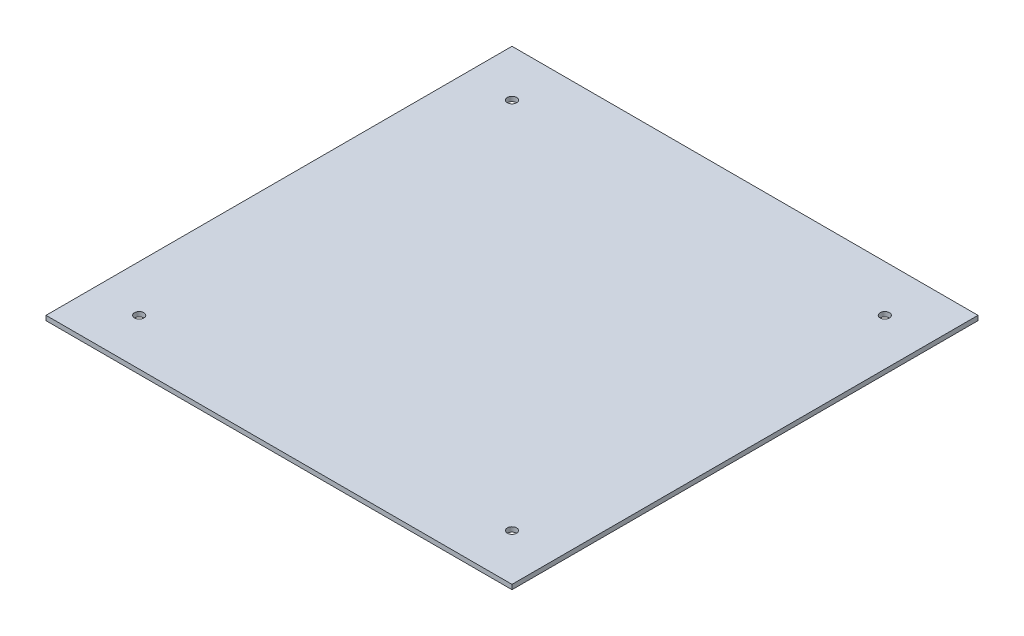
ISO-10303-21;
HEADER;
FILE_DESCRIPTION(('STEP AP214'),'2;1');
FILE_NAME('part.step','',(''),(''),'','','');
FILE_SCHEMA(('AUTOMOTIVE_DESIGN { 1 0 10303 214 1 1 1 1 }'));
ENDSEC;
DATA;
#1=APPLICATION_CONTEXT('core data for automotive mechanical design processes');
#2=APPLICATION_PROTOCOL_DEFINITION('international standard','automotive_design',2000,#1);
#3=PRODUCT_CONTEXT('',#1,'mechanical');
#4=PRODUCT('Part','Part','',(#3));
#5=PRODUCT_RELATED_PRODUCT_CATEGORY('part','',(#4));
#6=PRODUCT_DEFINITION_FORMATION('','',#4);
#7=PRODUCT_DEFINITION_CONTEXT('part definition',#1,'design');
#8=PRODUCT_DEFINITION('design','',#6,#7);
#9=PRODUCT_DEFINITION_SHAPE('','',#8);
#10=(LENGTH_UNIT() NAMED_UNIT(*) SI_UNIT(.MILLI.,.METRE.));
#11=(NAMED_UNIT(*) PLANE_ANGLE_UNIT() SI_UNIT($,.RADIAN.));
#12=(NAMED_UNIT(*) SI_UNIT($,.STERADIAN.) SOLID_ANGLE_UNIT());
#13=UNCERTAINTY_MEASURE_WITH_UNIT(LENGTH_MEASURE(1.E-05),#10,'distance_accuracy_value','');
#14=(GEOMETRIC_REPRESENTATION_CONTEXT(3) GLOBAL_UNCERTAINTY_ASSIGNED_CONTEXT((#13)) GLOBAL_UNIT_ASSIGNED_CONTEXT((#10,
#11,#12)) REPRESENTATION_CONTEXT('',''));
#15=CARTESIAN_POINT('',(0.,0.,0.));
#16=DIRECTION('',(0.,0.,1.));
#17=DIRECTION('',(1.,0.,0.));
#18=AXIS2_PLACEMENT_3D('',#15,#16,#17);
#19=CARTESIAN_POINT('',(250.,5.,-250.));
#20=DIRECTION('',(-1.,0.,0.));
#21=DIRECTION('',(0.,0.,1.));
#22=AXIS2_PLACEMENT_3D('',#19,#20,#21);
#23=PLANE('',#22);
#24=DIRECTION('',(0.,0.,-1.));
#25=VECTOR('',#24,1.);
#26=CARTESIAN_POINT('',(250.,0.,-250.));
#27=LINE('',#26,#25);
#28=CARTESIAN_POINT('',(250.,0.,250.));
#29=VERTEX_POINT('',#28);
#30=CARTESIAN_POINT('',(250.,0.,-250.));
#31=VERTEX_POINT('',#30);
#32=EDGE_CURVE('E101',#29,#31,#27,.T.);
#33=ORIENTED_EDGE('',*,*,#32,.T.);
#34=DIRECTION('',(0.,-1.,0.));
#35=VECTOR('',#34,1.);
#36=CARTESIAN_POINT('',(250.,5.,-250.));
#37=LINE('',#36,#35);
#38=CARTESIAN_POINT('',(250.,5.,-250.));
#39=VERTEX_POINT('',#38);
#40=EDGE_CURVE('E11',#39,#31,#37,.T.);
#41=ORIENTED_EDGE('',*,*,#40,.F.);
#42=DIRECTION('',(0.,0.,-1.));
#43=VECTOR('',#42,1.);
#44=CARTESIAN_POINT('',(250.,5.,-250.));
#45=LINE('',#44,#43);
#46=CARTESIAN_POINT('',(250.,5.,250.));
#47=VERTEX_POINT('',#46);
#48=EDGE_CURVE('E88',#47,#39,#45,.T.);
#49=ORIENTED_EDGE('',*,*,#48,.F.);
#50=DIRECTION('',(0.,-1.,0.));
#51=VECTOR('',#50,1.);
#52=CARTESIAN_POINT('',(250.,5.,250.));
#53=LINE('',#52,#51);
#54=EDGE_CURVE('E97',#47,#29,#53,.T.);
#55=ORIENTED_EDGE('',*,*,#54,.T.);
#56=EDGE_LOOP('',(#33,#41,#49,#55));
#57=FACE_BOUND('',#56,.T.);
#58=ADVANCED_FACE('F35',(#57),#23,.F.);
#59=CARTESIAN_POINT('',(-250.,5.,-250.));
#60=DIRECTION('',(0.,0.,1.));
#61=DIRECTION('',(1.,0.,0.));
#62=AXIS2_PLACEMENT_3D('',#59,#60,#61);
#63=PLANE('',#62);
#64=DIRECTION('',(-1.,0.,0.));
#65=VECTOR('',#64,1.);
#66=CARTESIAN_POINT('',(-250.,0.,-250.));
#67=LINE('',#66,#65);
#68=CARTESIAN_POINT('',(-250.,0.,-250.));
#69=VERTEX_POINT('',#68);
#70=EDGE_CURVE('E92',#31,#69,#67,.T.);
#71=ORIENTED_EDGE('',*,*,#70,.T.);
#72=DIRECTION('',(0.,-1.,0.));
#73=VECTOR('',#72,1.);
#74=CARTESIAN_POINT('',(-250.,5.,-250.));
#75=LINE('',#74,#73);
#76=CARTESIAN_POINT('',(-250.,5.,-250.));
#77=VERTEX_POINT('',#76);
#78=EDGE_CURVE('E44',#77,#69,#75,.T.);
#79=ORIENTED_EDGE('',*,*,#78,.F.);
#80=DIRECTION('',(-1.,0.,0.));
#81=VECTOR('',#80,1.);
#82=CARTESIAN_POINT('',(-250.,5.,-250.));
#83=LINE('',#82,#81);
#84=EDGE_CURVE('E83',#39,#77,#83,.T.);
#85=ORIENTED_EDGE('',*,*,#84,.F.);
#86=ORIENTED_EDGE('',*,*,#40,.T.);
#87=EDGE_LOOP('',(#71,#79,#85,#86));
#88=FACE_BOUND('',#87,.T.);
#89=ADVANCED_FACE('F91',(#88),#63,.F.);
#90=CARTESIAN_POINT('',(-250.,5.,-250.));
#91=DIRECTION('',(1.,0.,0.));
#92=DIRECTION('',(0.,0.,-1.));
#93=AXIS2_PLACEMENT_3D('',#90,#91,#92);
#94=PLANE('',#93);
#95=DIRECTION('',(0.,0.,1.));
#96=VECTOR('',#95,1.);
#97=CARTESIAN_POINT('',(-250.,0.,-250.));
#98=LINE('',#97,#96);
#99=CARTESIAN_POINT('',(-250.,0.,250.));
#100=VERTEX_POINT('',#99);
#101=EDGE_CURVE('E70',#69,#100,#98,.T.);
#102=ORIENTED_EDGE('',*,*,#101,.T.);
#103=DIRECTION('',(0.,-1.,0.));
#104=VECTOR('',#103,1.);
#105=CARTESIAN_POINT('',(-250.,5.,250.));
#106=LINE('',#105,#104);
#107=CARTESIAN_POINT('',(-250.,5.,250.));
#108=VERTEX_POINT('',#107);
#109=EDGE_CURVE('E93',#108,#100,#106,.T.);
#110=ORIENTED_EDGE('',*,*,#109,.F.);
#111=DIRECTION('',(0.,0.,1.));
#112=VECTOR('',#111,1.);
#113=CARTESIAN_POINT('',(-250.,5.,-250.));
#114=LINE('',#113,#112);
#115=EDGE_CURVE('E86',#77,#108,#114,.T.);
#116=ORIENTED_EDGE('',*,*,#115,.F.);
#117=ORIENTED_EDGE('',*,*,#78,.T.);
#118=EDGE_LOOP('',(#102,#110,#116,#117));
#119=FACE_BOUND('',#118,.T.);
#120=ADVANCED_FACE('F95',(#119),#94,.F.);
#121=CARTESIAN_POINT('',(-250.,5.,250.));
#122=DIRECTION('',(0.,0.,-1.));
#123=DIRECTION('',(-1.,0.,0.));
#124=AXIS2_PLACEMENT_3D('',#121,#122,#123);
#125=PLANE('',#124);
#126=DIRECTION('',(1.,0.,0.));
#127=VECTOR('',#126,1.);
#128=CARTESIAN_POINT('',(-250.,0.,250.));
#129=LINE('',#128,#127);
#130=EDGE_CURVE('E76',#100,#29,#129,.T.);
#131=ORIENTED_EDGE('',*,*,#130,.T.);
#132=ORIENTED_EDGE('',*,*,#54,.F.);
#133=DIRECTION('',(1.,0.,0.));
#134=VECTOR('',#133,1.);
#135=CARTESIAN_POINT('',(-250.,5.,250.));
#136=LINE('',#135,#134);
#137=EDGE_CURVE('E53',#108,#47,#136,.T.);
#138=ORIENTED_EDGE('',*,*,#137,.F.);
#139=ORIENTED_EDGE('',*,*,#109,.T.);
#140=EDGE_LOOP('',(#131,#132,#138,#139));
#141=FACE_BOUND('',#140,.T.);
#142=ADVANCED_FACE('F139',(#141),#125,.F.);
#143=CARTESIAN_POINT('',(0.,5.,0.));
#144=DIRECTION('',(0.,1.,0.));
#145=DIRECTION('',(0.,0.,1.));
#146=AXIS2_PLACEMENT_3D('',#143,#144,#145);
#147=PLANE('',#146);
#148=CARTESIAN_POINT('',(200.,5.,200.));
#149=DIRECTION('',(0.,1.,0.));
#150=DIRECTION('',(0.,0.,1.));
#151=AXIS2_PLACEMENT_3D('',#148,#149,#150);
#152=CIRCLE('',#151,4.99999999999999);
#153=CARTESIAN_POINT('',(200.,5.,205.));
#154=VERTEX_POINT('',#153);
#155=EDGE_CURVE('E128',#154,#154,#152,.T.);
#156=ORIENTED_EDGE('',*,*,#155,.F.);
#157=EDGE_LOOP('',(#156));
#158=FACE_BOUND('',#157,.T.);
#159=CARTESIAN_POINT('',(200.,5.,-200.));
#160=DIRECTION('',(0.,1.,0.));
#161=DIRECTION('',(0.,0.,1.));
#162=AXIS2_PLACEMENT_3D('',#159,#160,#161);
#163=CIRCLE('',#162,4.99999999999999);
#164=CARTESIAN_POINT('',(200.,5.,-195.));
#165=VERTEX_POINT('',#164);
#166=EDGE_CURVE('E118',#165,#165,#163,.T.);
#167=ORIENTED_EDGE('',*,*,#166,.F.);
#168=EDGE_LOOP('',(#167));
#169=FACE_BOUND('',#168,.T.);
#170=CARTESIAN_POINT('',(-200.,5.,200.));
#171=DIRECTION('',(0.,1.,0.));
#172=DIRECTION('',(0.,0.,1.));
#173=AXIS2_PLACEMENT_3D('',#170,#171,#172);
#174=CIRCLE('',#173,4.99999999999999);
#175=CARTESIAN_POINT('',(-200.,5.,205.));
#176=VERTEX_POINT('',#175);
#177=EDGE_CURVE('E115',#176,#176,#174,.T.);
#178=ORIENTED_EDGE('',*,*,#177,.F.);
#179=EDGE_LOOP('',(#178));
#180=FACE_BOUND('',#179,.T.);
#181=CARTESIAN_POINT('',(-200.,5.,-200.));
#182=DIRECTION('',(0.,1.,0.));
#183=DIRECTION('',(0.,0.,1.));
#184=AXIS2_PLACEMENT_3D('',#181,#182,#183);
#185=CIRCLE('',#184,4.99999999999999);
#186=CARTESIAN_POINT('',(-200.,5.,-195.));
#187=VERTEX_POINT('',#186);
#188=EDGE_CURVE('E112',#187,#187,#185,.T.);
#189=ORIENTED_EDGE('',*,*,#188,.F.);
#190=EDGE_LOOP('',(#189));
#191=FACE_BOUND('',#190,.T.);
#192=ORIENTED_EDGE('',*,*,#48,.T.);
#193=ORIENTED_EDGE('',*,*,#84,.T.);
#194=ORIENTED_EDGE('',*,*,#115,.T.);
#195=ORIENTED_EDGE('',*,*,#137,.T.);
#196=EDGE_LOOP('',(#192,#193,#194,#195));
#197=FACE_BOUND('',#196,.T.);
#198=ADVANCED_FACE('F84',(#158,#169,#180,#191,#197),#147,.T.);
#199=CARTESIAN_POINT('',(0.,0.,0.));
#200=DIRECTION('',(0.,1.,0.));
#201=DIRECTION('',(0.,0.,1.));
#202=AXIS2_PLACEMENT_3D('',#199,#200,#201);
#203=PLANE('',#202);
#204=CARTESIAN_POINT('',(200.,0.,200.));
#205=DIRECTION('',(0.,1.,0.));
#206=DIRECTION('',(0.,0.,1.));
#207=AXIS2_PLACEMENT_3D('',#204,#205,#206);
#208=CIRCLE('',#207,4.99999999999999);
#209=CARTESIAN_POINT('',(200.,0.,205.));
#210=VERTEX_POINT('',#209);
#211=EDGE_CURVE('E38',#210,#210,#208,.T.);
#212=ORIENTED_EDGE('',*,*,#211,.T.);
#213=EDGE_LOOP('',(#212));
#214=FACE_BOUND('',#213,.T.);
#215=CARTESIAN_POINT('',(200.,0.,-200.));
#216=DIRECTION('',(0.,1.,0.));
#217=DIRECTION('',(0.,0.,1.));
#218=AXIS2_PLACEMENT_3D('',#215,#216,#217);
#219=CIRCLE('',#218,4.99999999999999);
#220=CARTESIAN_POINT('',(200.,0.,-195.));
#221=VERTEX_POINT('',#220);
#222=EDGE_CURVE('E116',#221,#221,#219,.T.);
#223=ORIENTED_EDGE('',*,*,#222,.T.);
#224=EDGE_LOOP('',(#223));
#225=FACE_BOUND('',#224,.T.);
#226=CARTESIAN_POINT('',(-200.,0.,200.));
#227=DIRECTION('',(0.,1.,0.));
#228=DIRECTION('',(0.,0.,1.));
#229=AXIS2_PLACEMENT_3D('',#226,#227,#228);
#230=CIRCLE('',#229,4.99999999999999);
#231=CARTESIAN_POINT('',(-200.,0.,205.));
#232=VERTEX_POINT('',#231);
#233=EDGE_CURVE('E113',#232,#232,#230,.T.);
#234=ORIENTED_EDGE('',*,*,#233,.T.);
#235=EDGE_LOOP('',(#234));
#236=FACE_BOUND('',#235,.T.);
#237=CARTESIAN_POINT('',(-200.,0.,-200.));
#238=DIRECTION('',(0.,1.,0.));
#239=DIRECTION('',(0.,0.,1.));
#240=AXIS2_PLACEMENT_3D('',#237,#238,#239);
#241=CIRCLE('',#240,4.99999999999999);
#242=CARTESIAN_POINT('',(-200.,0.,-195.));
#243=VERTEX_POINT('',#242);
#244=EDGE_CURVE('E104',#243,#243,#241,.T.);
#245=ORIENTED_EDGE('',*,*,#244,.T.);
#246=EDGE_LOOP('',(#245));
#247=FACE_BOUND('',#246,.T.);
#248=ORIENTED_EDGE('',*,*,#32,.F.);
#249=ORIENTED_EDGE('',*,*,#130,.F.);
#250=ORIENTED_EDGE('',*,*,#101,.F.);
#251=ORIENTED_EDGE('',*,*,#70,.F.);
#252=EDGE_LOOP('',(#248,#249,#250,#251));
#253=FACE_BOUND('',#252,.T.);
#254=ADVANCED_FACE('F138',(#214,#225,#236,#247,#253),#203,.F.);
#255=CARTESIAN_POINT('',(-200.,-5.,-200.));
#256=DIRECTION('',(0.,1.,0.));
#257=DIRECTION('',(0.,0.,1.));
#258=AXIS2_PLACEMENT_3D('',#255,#256,#257);
#259=CYLINDRICAL_SURFACE('',#258,4.99999999999999);
#260=ORIENTED_EDGE('',*,*,#188,.T.);
#261=EDGE_LOOP('',(#260));
#262=FACE_BOUND('',#261,.T.);
#263=ORIENTED_EDGE('',*,*,#244,.F.);
#264=EDGE_LOOP('',(#263));
#265=FACE_BOUND('',#264,.T.);
#266=ADVANCED_FACE('F134',(#262,#265),#259,.F.);
#267=CARTESIAN_POINT('',(-200.,-5.,200.));
#268=DIRECTION('',(0.,1.,0.));
#269=DIRECTION('',(0.,0.,1.));
#270=AXIS2_PLACEMENT_3D('',#267,#268,#269);
#271=CYLINDRICAL_SURFACE('',#270,4.99999999999999);
#272=ORIENTED_EDGE('',*,*,#177,.T.);
#273=EDGE_LOOP('',(#272));
#274=FACE_BOUND('',#273,.T.);
#275=ORIENTED_EDGE('',*,*,#233,.F.);
#276=EDGE_LOOP('',(#275));
#277=FACE_BOUND('',#276,.T.);
#278=ADVANCED_FACE('F189',(#274,#277),#271,.F.);
#279=CARTESIAN_POINT('',(200.,-5.,-200.));
#280=DIRECTION('',(0.,1.,0.));
#281=DIRECTION('',(0.,0.,1.));
#282=AXIS2_PLACEMENT_3D('',#279,#280,#281);
#283=CYLINDRICAL_SURFACE('',#282,4.99999999999999);
#284=ORIENTED_EDGE('',*,*,#166,.T.);
#285=EDGE_LOOP('',(#284));
#286=FACE_BOUND('',#285,.T.);
#287=ORIENTED_EDGE('',*,*,#222,.F.);
#288=EDGE_LOOP('',(#287));
#289=FACE_BOUND('',#288,.T.);
#290=ADVANCED_FACE('F195',(#286,#289),#283,.F.);
#291=CARTESIAN_POINT('',(200.,-5.,200.));
#292=DIRECTION('',(0.,1.,0.));
#293=DIRECTION('',(0.,0.,1.));
#294=AXIS2_PLACEMENT_3D('',#291,#292,#293);
#295=CYLINDRICAL_SURFACE('',#294,4.99999999999999);
#296=ORIENTED_EDGE('',*,*,#155,.T.);
#297=EDGE_LOOP('',(#296));
#298=FACE_BOUND('',#297,.T.);
#299=ORIENTED_EDGE('',*,*,#211,.F.);
#300=EDGE_LOOP('',(#299));
#301=FACE_BOUND('',#300,.T.);
#302=ADVANCED_FACE('F203',(#298,#301),#295,.F.);
#303=CLOSED_SHELL('',(#58,#89,#120,#142,#198,#254,#266,#278,#290,#302));
#304=MANIFOLD_SOLID_BREP('B2',#303);
#305=ADVANCED_BREP_SHAPE_REPRESENTATION('',(#18,#304),#14);
#306=SHAPE_DEFINITION_REPRESENTATION(#9,#305);
ENDSEC;
END-ISO-10303-21;
